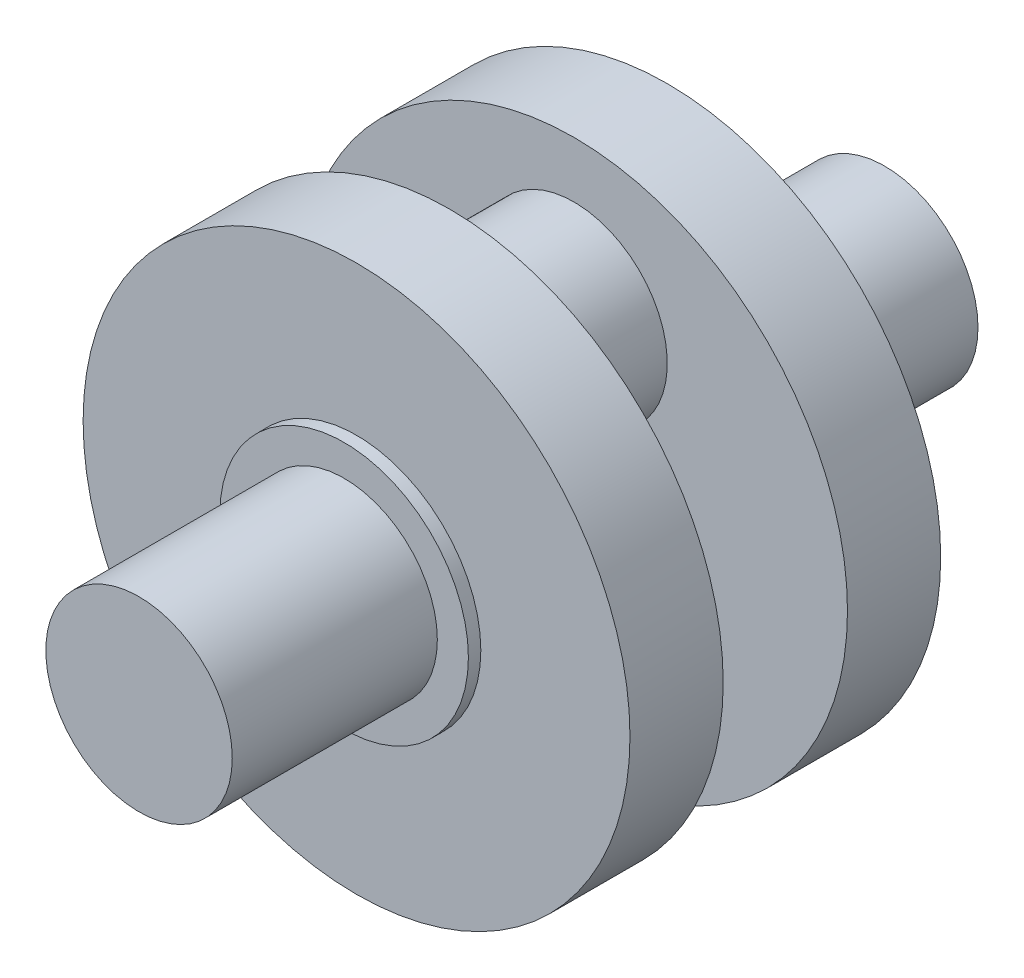
ISO-10303-21;
HEADER;
FILE_DESCRIPTION(('STEP AP214'),'2;1');
FILE_NAME('part.step','',(''),(''),'','','');
FILE_SCHEMA(('AUTOMOTIVE_DESIGN { 1 0 10303 214 1 1 1 1 }'));
ENDSEC;
DATA;
#1=APPLICATION_CONTEXT('core data for automotive mechanical design processes');
#2=APPLICATION_PROTOCOL_DEFINITION('international standard','automotive_design',2000,#1);
#3=PRODUCT_CONTEXT('',#1,'mechanical');
#4=PRODUCT('Part','Part','',(#3));
#5=PRODUCT_RELATED_PRODUCT_CATEGORY('part','',(#4));
#6=PRODUCT_DEFINITION_FORMATION('','',#4);
#7=PRODUCT_DEFINITION_CONTEXT('part definition',#1,'design');
#8=PRODUCT_DEFINITION('design','',#6,#7);
#9=PRODUCT_DEFINITION_SHAPE('','',#8);
#10=(LENGTH_UNIT() NAMED_UNIT(*) SI_UNIT(.MILLI.,.METRE.));
#11=(NAMED_UNIT(*) PLANE_ANGLE_UNIT() SI_UNIT($,.RADIAN.));
#12=(NAMED_UNIT(*) SI_UNIT($,.STERADIAN.) SOLID_ANGLE_UNIT());
#13=UNCERTAINTY_MEASURE_WITH_UNIT(LENGTH_MEASURE(1.E-05),#10,'distance_accuracy_value','');
#14=(GEOMETRIC_REPRESENTATION_CONTEXT(3) GLOBAL_UNCERTAINTY_ASSIGNED_CONTEXT((#13)) GLOBAL_UNIT_ASSIGNED_CONTEXT((#10,
#11,#12)) REPRESENTATION_CONTEXT('',''));
#15=CARTESIAN_POINT('',(0.,0.,0.));
#16=DIRECTION('',(0.,0.,1.));
#17=DIRECTION('',(1.,0.,0.));
#18=AXIS2_PLACEMENT_3D('',#15,#16,#17);
#19=CARTESIAN_POINT('',(0.,0.,33.));
#20=DIRECTION('',(0.,0.,-1.));
#21=DIRECTION('',(-1.,0.,0.));
#22=AXIS2_PLACEMENT_3D('',#19,#20,#21);
#23=CYLINDRICAL_SURFACE('',#22,15.);
#24=CARTESIAN_POINT('',(0.,0.,33.));
#25=DIRECTION('',(0.,0.,1.));
#26=DIRECTION('',(1.,0.,0.));
#27=AXIS2_PLACEMENT_3D('',#24,#25,#26);
#28=CIRCLE('',#27,15.);
#29=CARTESIAN_POINT('',(15.,0.,33.));
#30=VERTEX_POINT('',#29);
#31=EDGE_CURVE('E10',#30,#30,#28,.T.);
#32=ORIENTED_EDGE('',*,*,#31,.F.);
#33=EDGE_LOOP('',(#32));
#34=FACE_BOUND('',#33,.T.);
#35=CARTESIAN_POINT('',(0.,0.,0.));
#36=DIRECTION('',(0.,0.,1.));
#37=DIRECTION('',(1.,0.,0.));
#38=AXIS2_PLACEMENT_3D('',#35,#36,#37);
#39=CIRCLE('',#38,15.);
#40=CARTESIAN_POINT('',(15.,0.,0.));
#41=VERTEX_POINT('',#40);
#42=EDGE_CURVE('E48',#41,#41,#39,.T.);
#43=ORIENTED_EDGE('',*,*,#42,.T.);
#44=EDGE_LOOP('',(#43));
#45=FACE_BOUND('',#44,.T.);
#46=ADVANCED_FACE('F45',(#34,#45),#23,.T.);
#47=CARTESIAN_POINT('',(0.,0.,33.));
#48=DIRECTION('',(0.,0.,1.));
#49=DIRECTION('',(1.,0.,0.));
#50=AXIS2_PLACEMENT_3D('',#47,#48,#49);
#51=PLANE('',#50);
#52=ORIENTED_EDGE('',*,*,#31,.T.);
#53=EDGE_LOOP('',(#52));
#54=FACE_BOUND('',#53,.T.);
#55=ADVANCED_FACE('F129',(#54),#51,.T.);
#56=CARTESIAN_POINT('',(0.,0.,-2.));
#57=DIRECTION('',(0.,0.,1.));
#58=DIRECTION('',(1.,0.,0.));
#59=AXIS2_PLACEMENT_3D('',#56,#57,#58);
#60=CYLINDRICAL_SURFACE('',#59,20.);
#61=CARTESIAN_POINT('',(0.,0.,-2.));
#62=DIRECTION('',(0.,0.,1.));
#63=DIRECTION('',(1.,0.,0.));
#64=AXIS2_PLACEMENT_3D('',#61,#62,#63);
#65=CIRCLE('',#64,20.);
#66=CARTESIAN_POINT('',(20.,0.,-2.));
#67=VERTEX_POINT('',#66);
#68=EDGE_CURVE('E62',#67,#67,#65,.T.);
#69=ORIENTED_EDGE('',*,*,#68,.T.);
#70=EDGE_LOOP('',(#69));
#71=FACE_BOUND('',#70,.T.);
#72=CARTESIAN_POINT('',(0.,0.,0.));
#73=DIRECTION('',(0.,0.,1.));
#74=DIRECTION('',(1.,0.,0.));
#75=AXIS2_PLACEMENT_3D('',#72,#73,#74);
#76=CIRCLE('',#75,20.);
#77=CARTESIAN_POINT('',(20.,0.,0.));
#78=VERTEX_POINT('',#77);
#79=EDGE_CURVE('E57',#78,#78,#76,.T.);
#80=ORIENTED_EDGE('',*,*,#79,.F.);
#81=EDGE_LOOP('',(#80));
#82=FACE_BOUND('',#81,.T.);
#83=ADVANCED_FACE('F134',(#71,#82),#60,.T.);
#84=CARTESIAN_POINT('',(0.,0.,0.));
#85=DIRECTION('',(0.,0.,1.));
#86=DIRECTION('',(1.,0.,0.));
#87=AXIS2_PLACEMENT_3D('',#84,#85,#86);
#88=PLANE('',#87);
#89=ORIENTED_EDGE('',*,*,#42,.F.);
#90=EDGE_LOOP('',(#89));
#91=FACE_BOUND('',#90,.T.);
#92=ORIENTED_EDGE('',*,*,#79,.T.);
#93=EDGE_LOOP('',(#92));
#94=FACE_BOUND('',#93,.T.);
#95=ADVANCED_FACE('F138',(#91,#94),#88,.T.);
#96=CARTESIAN_POINT('',(0.,0.,-17.));
#97=DIRECTION('',(0.,0.,1.));
#98=DIRECTION('',(1.,0.,0.));
#99=AXIS2_PLACEMENT_3D('',#96,#97,#98);
#100=CYLINDRICAL_SURFACE('',#99,44.);
#101=CARTESIAN_POINT('',(0.,0.,-17.));
#102=DIRECTION('',(0.,0.,-1.));
#103=DIRECTION('',(-1.,0.,0.));
#104=AXIS2_PLACEMENT_3D('',#101,#102,#103);
#105=CIRCLE('',#104,44.);
#106=CARTESIAN_POINT('',(-44.,0.,-17.));
#107=VERTEX_POINT('',#106);
#108=EDGE_CURVE('E66',#107,#107,#105,.T.);
#109=ORIENTED_EDGE('',*,*,#108,.F.);
#110=EDGE_LOOP('',(#109));
#111=FACE_BOUND('',#110,.T.);
#112=CARTESIAN_POINT('',(0.,0.,-2.));
#113=DIRECTION('',(0.,0.,-1.));
#114=DIRECTION('',(-1.,0.,0.));
#115=AXIS2_PLACEMENT_3D('',#112,#113,#114);
#116=CIRCLE('',#115,44.);
#117=CARTESIAN_POINT('',(-44.,0.,-2.));
#118=VERTEX_POINT('',#117);
#119=EDGE_CURVE('E67',#118,#118,#116,.T.);
#120=ORIENTED_EDGE('',*,*,#119,.T.);
#121=EDGE_LOOP('',(#120));
#122=FACE_BOUND('',#121,.T.);
#123=ADVANCED_FACE('F141',(#111,#122),#100,.T.);
#124=CARTESIAN_POINT('',(0.,0.,-17.));
#125=DIRECTION('',(0.,0.,-1.));
#126=DIRECTION('',(-1.,0.,0.));
#127=AXIS2_PLACEMENT_3D('',#124,#125,#126);
#128=PLANE('',#127);
#129=CARTESIAN_POINT('',(0.,20.,-17.));
#130=DIRECTION('',(0.,0.,-1.));
#131=DIRECTION('',(-1.,0.,0.));
#132=AXIS2_PLACEMENT_3D('',#129,#130,#131);
#133=CIRCLE('',#132,15.);
#134=CARTESIAN_POINT('',(-15.,20.,-17.));
#135=VERTEX_POINT('',#134);
#136=EDGE_CURVE('E71',#135,#135,#133,.T.);
#137=ORIENTED_EDGE('',*,*,#136,.F.);
#138=EDGE_LOOP('',(#137));
#139=FACE_BOUND('',#138,.T.);
#140=ORIENTED_EDGE('',*,*,#108,.T.);
#141=EDGE_LOOP('',(#140));
#142=FACE_BOUND('',#141,.T.);
#143=ADVANCED_FACE('F124',(#139,#142),#128,.T.);
#144=CARTESIAN_POINT('',(0.,0.,-2.));
#145=DIRECTION('',(0.,0.,-1.));
#146=DIRECTION('',(-1.,0.,0.));
#147=AXIS2_PLACEMENT_3D('',#144,#145,#146);
#148=PLANE('',#147);
#149=ORIENTED_EDGE('',*,*,#68,.F.);
#150=EDGE_LOOP('',(#149));
#151=FACE_BOUND('',#150,.T.);
#152=ORIENTED_EDGE('',*,*,#119,.F.);
#153=EDGE_LOOP('',(#152));
#154=FACE_BOUND('',#153,.T.);
#155=ADVANCED_FACE('F113',(#151,#154),#148,.F.);
#156=CARTESIAN_POINT('',(0.,20.,-27.));
#157=DIRECTION('',(0.,0.,1.));
#158=DIRECTION('',(1.,0.,0.));
#159=AXIS2_PLACEMENT_3D('',#156,#157,#158);
#160=CYLINDRICAL_SURFACE('',#159,15.);
#161=ORIENTED_EDGE('',*,*,#136,.T.);
#162=EDGE_LOOP('',(#161));
#163=FACE_BOUND('',#162,.T.);
#164=CARTESIAN_POINT('',(0.,20.,-37.));
#165=DIRECTION('',(0.,0.,-1.));
#166=DIRECTION('',(-1.,0.,0.));
#167=AXIS2_PLACEMENT_3D('',#164,#165,#166);
#168=CIRCLE('',#167,15.);
#169=CARTESIAN_POINT('',(-15.,20.,-37.));
#170=VERTEX_POINT('',#169);
#171=EDGE_CURVE('E99',#170,#170,#168,.T.);
#172=ORIENTED_EDGE('',*,*,#171,.F.);
#173=EDGE_LOOP('',(#172));
#174=FACE_BOUND('',#173,.T.);
#175=ADVANCED_FACE('F110',(#163,#174),#160,.T.);
#176=CARTESIAN_POINT('',(0.,0.,-87.));
#177=DIRECTION('',(0.,0.,1.));
#178=DIRECTION('',(-1.,0.,0.));
#179=AXIS2_PLACEMENT_3D('',#176,#177,#178);
#180=CYLINDRICAL_SURFACE('',#179,15.);
#181=CARTESIAN_POINT('',(0.,0.,-87.));
#182=DIRECTION('',(0.,0.,1.));
#183=DIRECTION('',(1.,0.,0.));
#184=AXIS2_PLACEMENT_3D('',#181,#182,#183);
#185=CIRCLE('',#184,15.);
#186=CARTESIAN_POINT('',(15.,0.,-87.));
#187=VERTEX_POINT('',#186);
#188=EDGE_CURVE('E78',#187,#187,#185,.T.);
#189=ORIENTED_EDGE('',*,*,#188,.T.);
#190=EDGE_LOOP('',(#189));
#191=FACE_BOUND('',#190,.T.);
#192=CARTESIAN_POINT('',(0.,0.,-54.));
#193=DIRECTION('',(0.,0.,1.));
#194=DIRECTION('',(1.,0.,0.));
#195=AXIS2_PLACEMENT_3D('',#192,#193,#194);
#196=CIRCLE('',#195,15.);
#197=CARTESIAN_POINT('',(15.,0.,-54.));
#198=VERTEX_POINT('',#197);
#199=EDGE_CURVE('E79',#198,#198,#196,.T.);
#200=ORIENTED_EDGE('',*,*,#199,.F.);
#201=EDGE_LOOP('',(#200));
#202=FACE_BOUND('',#201,.T.);
#203=ADVANCED_FACE('F112',(#191,#202),#180,.T.);
#204=CARTESIAN_POINT('',(0.,0.,-87.));
#205=DIRECTION('',(0.,0.,-1.));
#206=DIRECTION('',(1.,0.,0.));
#207=AXIS2_PLACEMENT_3D('',#204,#205,#206);
#208=PLANE('',#207);
#209=ORIENTED_EDGE('',*,*,#188,.F.);
#210=EDGE_LOOP('',(#209));
#211=FACE_BOUND('',#210,.T.);
#212=ADVANCED_FACE('F120',(#211),#208,.T.);
#213=CARTESIAN_POINT('',(0.,0.,-52.));
#214=DIRECTION('',(0.,0.,-1.));
#215=DIRECTION('',(1.,0.,0.));
#216=AXIS2_PLACEMENT_3D('',#213,#214,#215);
#217=CYLINDRICAL_SURFACE('',#216,20.);
#218=CARTESIAN_POINT('',(0.,0.,-52.));
#219=DIRECTION('',(0.,0.,1.));
#220=DIRECTION('',(1.,0.,0.));
#221=AXIS2_PLACEMENT_3D('',#218,#219,#220);
#222=CIRCLE('',#221,20.);
#223=CARTESIAN_POINT('',(20.,0.,-52.));
#224=VERTEX_POINT('',#223);
#225=EDGE_CURVE('E90',#224,#224,#222,.T.);
#226=ORIENTED_EDGE('',*,*,#225,.F.);
#227=EDGE_LOOP('',(#226));
#228=FACE_BOUND('',#227,.T.);
#229=CARTESIAN_POINT('',(0.,0.,-54.));
#230=DIRECTION('',(0.,0.,1.));
#231=DIRECTION('',(1.,0.,0.));
#232=AXIS2_PLACEMENT_3D('',#229,#230,#231);
#233=CIRCLE('',#232,20.);
#234=CARTESIAN_POINT('',(20.,0.,-54.));
#235=VERTEX_POINT('',#234);
#236=EDGE_CURVE('E83',#235,#235,#233,.T.);
#237=ORIENTED_EDGE('',*,*,#236,.T.);
#238=EDGE_LOOP('',(#237));
#239=FACE_BOUND('',#238,.T.);
#240=ADVANCED_FACE('F213',(#228,#239),#217,.T.);
#241=CARTESIAN_POINT('',(0.,0.,-54.));
#242=DIRECTION('',(0.,0.,-1.));
#243=DIRECTION('',(1.,0.,0.));
#244=AXIS2_PLACEMENT_3D('',#241,#242,#243);
#245=PLANE('',#244);
#246=ORIENTED_EDGE('',*,*,#199,.T.);
#247=EDGE_LOOP('',(#246));
#248=FACE_BOUND('',#247,.T.);
#249=ORIENTED_EDGE('',*,*,#236,.F.);
#250=EDGE_LOOP('',(#249));
#251=FACE_BOUND('',#250,.T.);
#252=ADVANCED_FACE('F223',(#248,#251),#245,.T.);
#253=CARTESIAN_POINT('',(0.,0.,-37.));
#254=DIRECTION('',(0.,0.,-1.));
#255=DIRECTION('',(1.,0.,0.));
#256=AXIS2_PLACEMENT_3D('',#253,#254,#255);
#257=CYLINDRICAL_SURFACE('',#256,44.);
#258=CARTESIAN_POINT('',(0.,0.,-37.));
#259=DIRECTION('',(0.,0.,-1.));
#260=DIRECTION('',(-1.,0.,0.));
#261=AXIS2_PLACEMENT_3D('',#258,#259,#260);
#262=CIRCLE('',#261,44.);
#263=CARTESIAN_POINT('',(-44.,0.,-37.));
#264=VERTEX_POINT('',#263);
#265=EDGE_CURVE('E94',#264,#264,#262,.T.);
#266=ORIENTED_EDGE('',*,*,#265,.T.);
#267=EDGE_LOOP('',(#266));
#268=FACE_BOUND('',#267,.T.);
#269=CARTESIAN_POINT('',(0.,0.,-52.));
#270=DIRECTION('',(0.,0.,-1.));
#271=DIRECTION('',(-1.,0.,0.));
#272=AXIS2_PLACEMENT_3D('',#269,#270,#271);
#273=CIRCLE('',#272,44.);
#274=CARTESIAN_POINT('',(-44.,0.,-52.));
#275=VERTEX_POINT('',#274);
#276=EDGE_CURVE('E95',#275,#275,#273,.T.);
#277=ORIENTED_EDGE('',*,*,#276,.F.);
#278=EDGE_LOOP('',(#277));
#279=FACE_BOUND('',#278,.T.);
#280=ADVANCED_FACE('F233',(#268,#279),#257,.T.);
#281=CARTESIAN_POINT('',(0.,0.,-37.));
#282=DIRECTION('',(0.,0.,1.));
#283=DIRECTION('',(-1.,0.,0.));
#284=AXIS2_PLACEMENT_3D('',#281,#282,#283);
#285=PLANE('',#284);
#286=ORIENTED_EDGE('',*,*,#171,.T.);
#287=EDGE_LOOP('',(#286));
#288=FACE_BOUND('',#287,.T.);
#289=ORIENTED_EDGE('',*,*,#265,.F.);
#290=EDGE_LOOP('',(#289));
#291=FACE_BOUND('',#290,.T.);
#292=ADVANCED_FACE('F107',(#288,#291),#285,.T.);
#293=CARTESIAN_POINT('',(0.,0.,-52.));
#294=DIRECTION('',(0.,0.,1.));
#295=DIRECTION('',(-1.,0.,0.));
#296=AXIS2_PLACEMENT_3D('',#293,#294,#295);
#297=PLANE('',#296);
#298=ORIENTED_EDGE('',*,*,#225,.T.);
#299=EDGE_LOOP('',(#298));
#300=FACE_BOUND('',#299,.T.);
#301=ORIENTED_EDGE('',*,*,#276,.T.);
#302=EDGE_LOOP('',(#301));
#303=FACE_BOUND('',#302,.T.);
#304=ADVANCED_FACE('F252',(#300,#303),#297,.F.);
#305=CLOSED_SHELL('',(#46,#55,#83,#95,#123,#143,#155,#175,#203,#212,#240,#252,#280,#292,#304));
#306=MANIFOLD_SOLID_BREP('B2',#305);
#307=ADVANCED_BREP_SHAPE_REPRESENTATION('',(#18,#306),#14);
#308=SHAPE_DEFINITION_REPRESENTATION(#9,#307);
ENDSEC;
END-ISO-10303-21;
